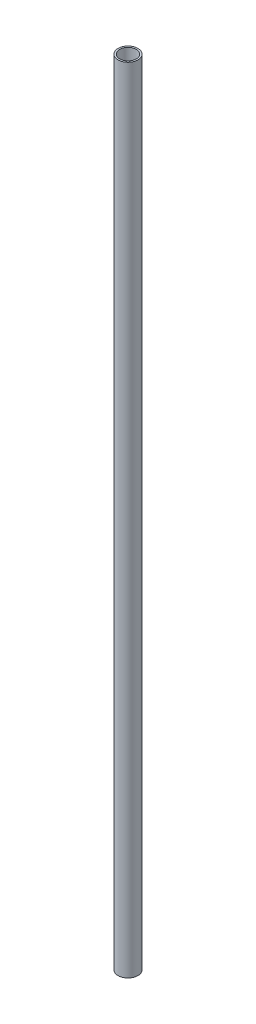
ISO-10303-21;
HEADER;
FILE_DESCRIPTION(('STEP AP214'),'2;1');
FILE_NAME('part.step','',(''),(''),'','','');
FILE_SCHEMA(('AUTOMOTIVE_DESIGN { 1 0 10303 214 1 1 1 1 }'));
ENDSEC;
DATA;
#1=APPLICATION_CONTEXT('core data for automotive mechanical design processes');
#2=APPLICATION_PROTOCOL_DEFINITION('international standard','automotive_design',2000,#1);
#3=PRODUCT_CONTEXT('',#1,'mechanical');
#4=PRODUCT('Part','Part','',(#3));
#5=PRODUCT_RELATED_PRODUCT_CATEGORY('part','',(#4));
#6=PRODUCT_DEFINITION_FORMATION('','',#4);
#7=PRODUCT_DEFINITION_CONTEXT('part definition',#1,'design');
#8=PRODUCT_DEFINITION('design','',#6,#7);
#9=PRODUCT_DEFINITION_SHAPE('','',#8);
#10=(LENGTH_UNIT() NAMED_UNIT(*) SI_UNIT(.MILLI.,.METRE.));
#11=(NAMED_UNIT(*) PLANE_ANGLE_UNIT() SI_UNIT($,.RADIAN.));
#12=(NAMED_UNIT(*) SI_UNIT($,.STERADIAN.) SOLID_ANGLE_UNIT());
#13=UNCERTAINTY_MEASURE_WITH_UNIT(LENGTH_MEASURE(1.E-05),#10,'distance_accuracy_value','');
#14=(GEOMETRIC_REPRESENTATION_CONTEXT(3) GLOBAL_UNCERTAINTY_ASSIGNED_CONTEXT((#13)) GLOBAL_UNIT_ASSIGNED_CONTEXT((#10,
#11,#12)) REPRESENTATION_CONTEXT('',''));
#15=CARTESIAN_POINT('',(0.,0.,0.));
#16=DIRECTION('',(0.,0.,1.));
#17=DIRECTION('',(1.,0.,0.));
#18=AXIS2_PLACEMENT_3D('',#15,#16,#17);
#19=CARTESIAN_POINT('',(682.625,838.202,455.168));
#20=DIRECTION('',(0.,1.,0.));
#21=DIRECTION('',(0.,0.,1.));
#22=AXIS2_PLACEMENT_3D('',#19,#20,#21);
#23=CYLINDRICAL_SURFACE('',#22,17.526);
#24=CARTESIAN_POINT('',(682.625,-838.2,455.168));
#25=DIRECTION('',(0.,1.,0.));
#26=DIRECTION('',(0.,0.,1.));
#27=AXIS2_PLACEMENT_3D('',#24,#25,#26);
#28=CIRCLE('',#27,17.526);
#29=CARTESIAN_POINT('',(682.625,-838.2,472.694));
#30=VERTEX_POINT('',#29);
#31=EDGE_CURVE('E30',#30,#30,#28,.T.);
#32=ORIENTED_EDGE('',*,*,#31,.F.);
#33=EDGE_LOOP('',(#32));
#34=FACE_BOUND('',#33,.T.);
#35=CARTESIAN_POINT('',(682.625,838.2,455.168));
#36=DIRECTION('',(0.,1.,0.));
#37=DIRECTION('',(0.,0.,1.));
#38=AXIS2_PLACEMENT_3D('',#35,#36,#37);
#39=CIRCLE('',#38,17.526);
#40=CARTESIAN_POINT('',(682.625,838.2,472.694));
#41=VERTEX_POINT('',#40);
#42=EDGE_CURVE('E17',#41,#41,#39,.T.);
#43=ORIENTED_EDGE('',*,*,#42,.T.);
#44=EDGE_LOOP('',(#43));
#45=FACE_BOUND('',#44,.T.);
#46=ADVANCED_FACE('F14',(#34,#45),#23,.F.);
#47=CARTESIAN_POINT('',(682.625,838.2,44.45));
#48=DIRECTION('',(0.,-1.,0.));
#49=DIRECTION('',(0.,0.,-1.));
#50=AXIS2_PLACEMENT_3D('',#47,#48,#49);
#51=PLANE('',#50);
#52=ORIENTED_EDGE('',*,*,#42,.F.);
#53=EDGE_LOOP('',(#52));
#54=FACE_BOUND('',#53,.T.);
#55=CARTESIAN_POINT('',(682.625,838.2,455.168));
#56=DIRECTION('',(0.,1.,0.));
#57=DIRECTION('',(0.,0.,1.));
#58=AXIS2_PLACEMENT_3D('',#55,#56,#57);
#59=CIRCLE('',#58,21.082);
#60=CARTESIAN_POINT('',(682.625,838.2,476.25));
#61=VERTEX_POINT('',#60);
#62=EDGE_CURVE('E22',#61,#61,#59,.F.);
#63=ORIENTED_EDGE('',*,*,#62,.F.);
#64=EDGE_LOOP('',(#63));
#65=FACE_BOUND('',#64,.T.);
#66=ADVANCED_FACE('F40',(#54,#65),#51,.F.);
#67=CARTESIAN_POINT('',(682.625,-838.2,260.35));
#68=DIRECTION('',(0.,-1.,0.));
#69=DIRECTION('',(0.,0.,-1.));
#70=AXIS2_PLACEMENT_3D('',#67,#68,#69);
#71=PLANE('',#70);
#72=CARTESIAN_POINT('',(682.625,-838.2,455.168));
#73=DIRECTION('',(0.,1.,0.));
#74=DIRECTION('',(0.,0.,1.));
#75=AXIS2_PLACEMENT_3D('',#72,#73,#74);
#76=CIRCLE('',#75,21.082);
#77=CARTESIAN_POINT('',(682.625,-838.2,476.25));
#78=VERTEX_POINT('',#77);
#79=EDGE_CURVE('E10',#78,#78,#76,.T.);
#80=ORIENTED_EDGE('',*,*,#79,.F.);
#81=EDGE_LOOP('',(#80));
#82=FACE_BOUND('',#81,.T.);
#83=ORIENTED_EDGE('',*,*,#31,.T.);
#84=EDGE_LOOP('',(#83));
#85=FACE_BOUND('',#84,.T.);
#86=ADVANCED_FACE('F43',(#82,#85),#71,.T.);
#87=CARTESIAN_POINT('',(682.625,838.202,455.168));
#88=DIRECTION('',(0.,1.,0.));
#89=DIRECTION('',(0.,0.,1.));
#90=AXIS2_PLACEMENT_3D('',#87,#88,#89);
#91=CYLINDRICAL_SURFACE('',#90,21.082);
#92=ORIENTED_EDGE('',*,*,#79,.T.);
#93=EDGE_LOOP('',(#92));
#94=FACE_BOUND('',#93,.T.);
#95=ORIENTED_EDGE('',*,*,#62,.T.);
#96=EDGE_LOOP('',(#95));
#97=FACE_BOUND('',#96,.T.);
#98=ADVANCED_FACE('F46',(#94,#97),#91,.T.);
#99=CLOSED_SHELL('',(#46,#66,#86,#98));
#100=MANIFOLD_SOLID_BREP('B1',#99);
#101=ADVANCED_BREP_SHAPE_REPRESENTATION('',(#18,#100),#14);
#102=SHAPE_DEFINITION_REPRESENTATION(#9,#101);
ENDSEC;
END-ISO-10303-21;
